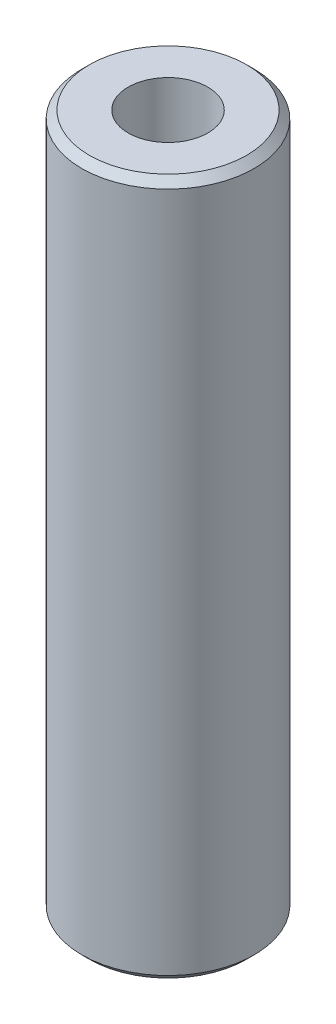
ISO-10303-21;
HEADER;
FILE_DESCRIPTION(('STEP AP214'),'2;1');
FILE_NAME('part.step','',(''),(''),'','','');
FILE_SCHEMA(('AUTOMOTIVE_DESIGN { 1 0 10303 214 1 1 1 1 }'));
ENDSEC;
DATA;
#1=APPLICATION_CONTEXT('core data for automotive mechanical design processes');
#2=APPLICATION_PROTOCOL_DEFINITION('international standard','automotive_design',2000,#1);
#3=PRODUCT_CONTEXT('',#1,'mechanical');
#4=PRODUCT('Part','Part','',(#3));
#5=PRODUCT_RELATED_PRODUCT_CATEGORY('part','',(#4));
#6=PRODUCT_DEFINITION_FORMATION('','',#4);
#7=PRODUCT_DEFINITION_CONTEXT('part definition',#1,'design');
#8=PRODUCT_DEFINITION('design','',#6,#7);
#9=PRODUCT_DEFINITION_SHAPE('','',#8);
#10=(LENGTH_UNIT() NAMED_UNIT(*) SI_UNIT(.MILLI.,.METRE.));
#11=(NAMED_UNIT(*) PLANE_ANGLE_UNIT() SI_UNIT($,.RADIAN.));
#12=(NAMED_UNIT(*) SI_UNIT($,.STERADIAN.) SOLID_ANGLE_UNIT());
#13=UNCERTAINTY_MEASURE_WITH_UNIT(LENGTH_MEASURE(1.E-05),#10,'distance_accuracy_value','');
#14=(GEOMETRIC_REPRESENTATION_CONTEXT(3) GLOBAL_UNCERTAINTY_ASSIGNED_CONTEXT((#13)) GLOBAL_UNIT_ASSIGNED_CONTEXT((#10,
#11,#12)) REPRESENTATION_CONTEXT('',''));
#15=CARTESIAN_POINT('',(0.,0.,0.));
#16=DIRECTION('',(0.,0.,1.));
#17=DIRECTION('',(1.,0.,0.));
#18=AXIS2_PLACEMENT_3D('',#15,#16,#17);
#19=CARTESIAN_POINT('',(0.,121.198954945809,0.));
#20=DIRECTION('',(0.,-1.,0.));
#21=DIRECTION('',(0.,0.,-1.));
#22=AXIS2_PLACEMENT_3D('',#19,#20,#21);
#23=CYLINDRICAL_SURFACE('',#22,15.);
#24=CARTESIAN_POINT('',(0.,119.876060767487,0.));
#25=DIRECTION('',(0.,1.,0.));
#26=DIRECTION('',(0.,0.,1.));
#27=AXIS2_PLACEMENT_3D('',#24,#25,#26);
#28=CIRCLE('',#27,15.);
#29=CARTESIAN_POINT('',(0.,119.876060767487,15.));
#30=VERTEX_POINT('',#29);
#31=EDGE_CURVE('E50',#30,#30,#28,.F.);
#32=ORIENTED_EDGE('',*,*,#31,.T.);
#33=EDGE_LOOP('',(#32));
#34=FACE_BOUND('',#33,.T.);
#35=CARTESIAN_POINT('',(0.,1.32289417832193,0.));
#36=DIRECTION('',(0.,1.,0.));
#37=DIRECTION('',(0.,0.,1.));
#38=AXIS2_PLACEMENT_3D('',#35,#36,#37);
#39=CIRCLE('',#38,15.);
#40=CARTESIAN_POINT('',(0.,1.32289417832193,15.));
#41=VERTEX_POINT('',#40);
#42=EDGE_CURVE('E51',#41,#41,#39,.T.);
#43=ORIENTED_EDGE('',*,*,#42,.T.);
#44=EDGE_LOOP('',(#43));
#45=FACE_BOUND('',#44,.T.);
#46=ADVANCED_FACE('F39',(#34,#45),#23,.T.);
#47=CARTESIAN_POINT('',(0.,121.198954945809,0.));
#48=DIRECTION('',(0.,1.,0.));
#49=DIRECTION('',(0.,0.,1.));
#50=AXIS2_PLACEMENT_3D('',#47,#48,#49);
#51=PLANE('',#50);
#52=CARTESIAN_POINT('',(0.,121.198954945809,0.));
#53=DIRECTION('',(0.,1.,0.));
#54=DIRECTION('',(0.,0.,1.));
#55=AXIS2_PLACEMENT_3D('',#52,#53,#54);
#56=CIRCLE('',#55,13.6771058216781);
#57=CARTESIAN_POINT('',(0.,121.198954945809,13.6771058216781));
#58=VERTEX_POINT('',#57);
#59=EDGE_CURVE('E54',#58,#58,#56,.T.);
#60=ORIENTED_EDGE('',*,*,#59,.T.);
#61=EDGE_LOOP('',(#60));
#62=FACE_BOUND('',#61,.T.);
#63=CARTESIAN_POINT('',(0.,121.198954945809,0.));
#64=DIRECTION('',(0.,1.,0.));
#65=DIRECTION('',(0.,0.,1.));
#66=AXIS2_PLACEMENT_3D('',#63,#64,#65);
#67=CIRCLE('',#66,6.92966858069819);
#68=CARTESIAN_POINT('',(0.,121.198954945809,6.92966858069819));
#69=VERTEX_POINT('',#68);
#70=EDGE_CURVE('E58',#69,#69,#67,.T.);
#71=ORIENTED_EDGE('',*,*,#70,.F.);
#72=EDGE_LOOP('',(#71));
#73=FACE_BOUND('',#72,.T.);
#74=ADVANCED_FACE('F69',(#62,#73),#51,.T.);
#75=CARTESIAN_POINT('',(0.,0.,0.));
#76=DIRECTION('',(0.,1.,0.));
#77=DIRECTION('',(0.,0.,1.));
#78=AXIS2_PLACEMENT_3D('',#75,#76,#77);
#79=PLANE('',#78);
#80=CARTESIAN_POINT('',(0.,0.,0.));
#81=DIRECTION('',(0.,1.,0.));
#82=DIRECTION('',(0.,0.,1.));
#83=AXIS2_PLACEMENT_3D('',#80,#81,#82);
#84=CIRCLE('',#83,13.6771058216781);
#85=CARTESIAN_POINT('',(0.,0.,13.6771058216781));
#86=VERTEX_POINT('',#85);
#87=EDGE_CURVE('E10',#86,#86,#84,.F.);
#88=ORIENTED_EDGE('',*,*,#87,.T.);
#89=EDGE_LOOP('',(#88));
#90=FACE_BOUND('',#89,.T.);
#91=CARTESIAN_POINT('',(0.,0.,0.));
#92=DIRECTION('',(0.,1.,0.));
#93=DIRECTION('',(0.,0.,1.));
#94=AXIS2_PLACEMENT_3D('',#91,#92,#93);
#95=CIRCLE('',#94,6.92966858069819);
#96=CARTESIAN_POINT('',(0.,0.,6.92966858069819));
#97=VERTEX_POINT('',#96);
#98=EDGE_CURVE('E63',#97,#97,#95,.T.);
#99=ORIENTED_EDGE('',*,*,#98,.T.);
#100=EDGE_LOOP('',(#99));
#101=FACE_BOUND('',#100,.T.);
#102=ADVANCED_FACE('F75',(#90,#101),#79,.F.);
#103=CARTESIAN_POINT('',(0.,121.198954945809,0.));
#104=DIRECTION('',(0.,-1.,0.));
#105=DIRECTION('',(0.,0.,-1.));
#106=AXIS2_PLACEMENT_3D('',#103,#104,#105);
#107=CYLINDRICAL_SURFACE('',#106,6.92966858069819);
#108=ORIENTED_EDGE('',*,*,#70,.T.);
#109=EDGE_LOOP('',(#108));
#110=FACE_BOUND('',#109,.T.);
#111=ORIENTED_EDGE('',*,*,#98,.F.);
#112=EDGE_LOOP('',(#111));
#113=FACE_BOUND('',#112,.T.);
#114=ADVANCED_FACE('F70',(#110,#113),#107,.F.);
#115=CARTESIAN_POINT('',(0.,121.198954945809,0.));
#116=DIRECTION('',(0.,-1.,0.));
#117=DIRECTION('',(0.,0.,-1.));
#118=AXIS2_PLACEMENT_3D('',#115,#116,#117);
#119=CONICAL_SURFACE('',#118,13.6771058216781,0.785398163397448);
#120=ORIENTED_EDGE('',*,*,#31,.F.);
#121=EDGE_LOOP('',(#120));
#122=FACE_BOUND('',#121,.T.);
#123=ORIENTED_EDGE('',*,*,#59,.F.);
#124=EDGE_LOOP('',(#123));
#125=FACE_BOUND('',#124,.T.);
#126=ADVANCED_FACE('F81',(#122,#125),#119,.T.);
#127=CARTESIAN_POINT('',(0.,1.32289417832193,0.));
#128=DIRECTION('',(0.,1.,0.));
#129=DIRECTION('',(0.,0.,1.));
#130=AXIS2_PLACEMENT_3D('',#127,#128,#129);
#131=CONICAL_SURFACE('',#130,15.,0.785398163397454);
#132=ORIENTED_EDGE('',*,*,#87,.F.);
#133=EDGE_LOOP('',(#132));
#134=FACE_BOUND('',#133,.T.);
#135=ORIENTED_EDGE('',*,*,#42,.F.);
#136=EDGE_LOOP('',(#135));
#137=FACE_BOUND('',#136,.T.);
#138=ADVANCED_FACE('F45',(#134,#137),#131,.T.);
#139=CLOSED_SHELL('',(#46,#74,#102,#114,#126,#138));
#140=MANIFOLD_SOLID_BREP('B2',#139);
#141=ADVANCED_BREP_SHAPE_REPRESENTATION('',(#18,#140),#14);
#142=SHAPE_DEFINITION_REPRESENTATION(#9,#141);
ENDSEC;
END-ISO-10303-21;
